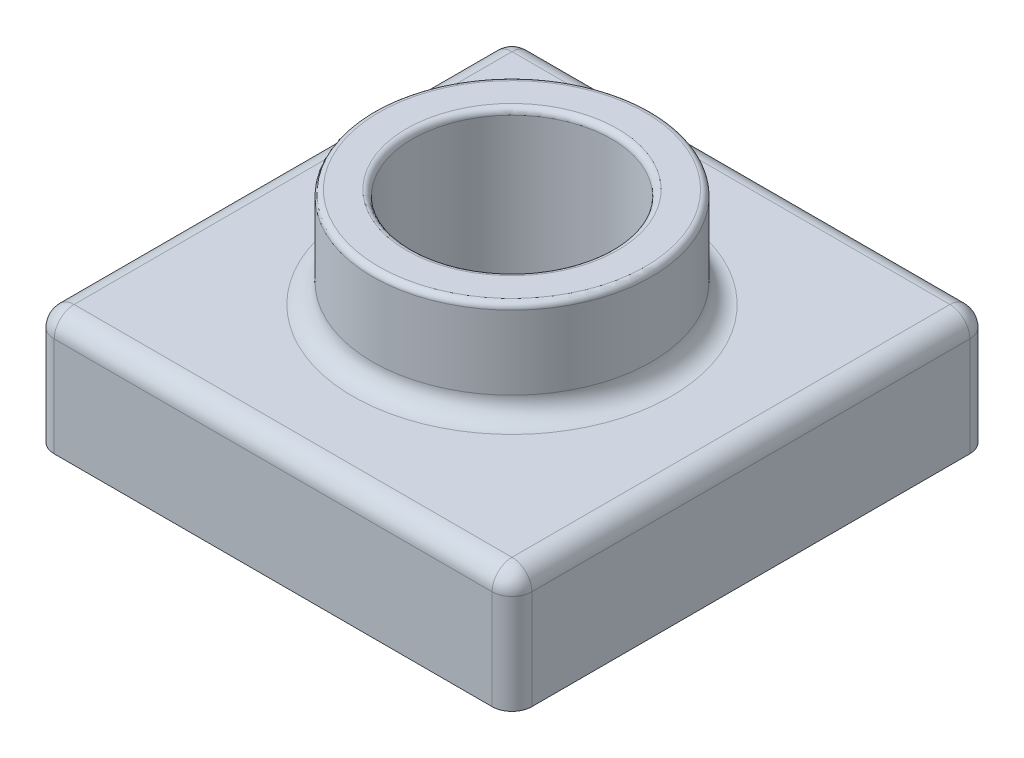
ISO-10303-21;
HEADER;
FILE_DESCRIPTION(('STEP AP214'),'2;1');
FILE_NAME('part.step','',(''),(''),'','','');
FILE_SCHEMA(('AUTOMOTIVE_DESIGN { 1 0 10303 214 1 1 1 1 }'));
ENDSEC;
DATA;
#1=APPLICATION_CONTEXT('core data for automotive mechanical design processes');
#2=APPLICATION_PROTOCOL_DEFINITION('international standard','automotive_design',2000,#1);
#3=PRODUCT_CONTEXT('',#1,'mechanical');
#4=PRODUCT('Part','Part','',(#3));
#5=PRODUCT_RELATED_PRODUCT_CATEGORY('part','',(#4));
#6=PRODUCT_DEFINITION_FORMATION('','',#4);
#7=PRODUCT_DEFINITION_CONTEXT('part definition',#1,'design');
#8=PRODUCT_DEFINITION('design','',#6,#7);
#9=PRODUCT_DEFINITION_SHAPE('','',#8);
#10=(LENGTH_UNIT() NAMED_UNIT(*) SI_UNIT(.MILLI.,.METRE.));
#11=(NAMED_UNIT(*) PLANE_ANGLE_UNIT() SI_UNIT($,.RADIAN.));
#12=(NAMED_UNIT(*) SI_UNIT($,.STERADIAN.) SOLID_ANGLE_UNIT());
#13=UNCERTAINTY_MEASURE_WITH_UNIT(LENGTH_MEASURE(1.E-05),#10,'distance_accuracy_value','');
#14=(GEOMETRIC_REPRESENTATION_CONTEXT(3) GLOBAL_UNCERTAINTY_ASSIGNED_CONTEXT((#13)) GLOBAL_UNIT_ASSIGNED_CONTEXT((#10,
#11,#12)) REPRESENTATION_CONTEXT('',''));
#15=CARTESIAN_POINT('',(0.,0.,0.));
#16=DIRECTION('',(0.,0.,1.));
#17=DIRECTION('',(1.,0.,0.));
#18=AXIS2_PLACEMENT_3D('',#15,#16,#17);
#19=CARTESIAN_POINT('',(0.,0.,0.));
#20=DIRECTION('',(0.,-1.,0.));
#21=DIRECTION('',(0.,0.,-1.));
#22=AXIS2_PLACEMENT_3D('',#19,#20,#21);
#23=PLANE('',#22);
#24=DIRECTION('',(0.,0.,1.));
#25=VECTOR('',#24,1.);
#26=CARTESIAN_POINT('',(0.,0.,0.));
#27=LINE('',#26,#25);
#28=CARTESIAN_POINT('',(0.,0.,-115.));
#29=VERTEX_POINT('',#28);
#30=CARTESIAN_POINT('',(0.,0.,-5.));
#31=VERTEX_POINT('',#30);
#32=EDGE_CURVE('E260',#29,#31,#27,.T.);
#33=ORIENTED_EDGE('',*,*,#32,.F.);
#34=CARTESIAN_POINT('',(5.,0.,-115.));
#35=DIRECTION('',(0.,-1.,0.));
#36=DIRECTION('',(0.,0.,-1.));
#37=AXIS2_PLACEMENT_3D('',#34,#35,#36);
#38=CIRCLE('',#37,5.);
#39=CARTESIAN_POINT('',(5.,0.,-120.));
#40=VERTEX_POINT('',#39);
#41=EDGE_CURVE('E318',#29,#40,#38,.T.);
#42=ORIENTED_EDGE('',*,*,#41,.T.);
#43=DIRECTION('',(-1.,0.,0.));
#44=VECTOR('',#43,1.);
#45=CARTESIAN_POINT('',(0.,0.,-120.));
#46=LINE('',#45,#44);
#47=CARTESIAN_POINT('',(115.,0.,-120.));
#48=VERTEX_POINT('',#47);
#49=EDGE_CURVE('E270',#48,#40,#46,.T.);
#50=ORIENTED_EDGE('',*,*,#49,.F.);
#51=CARTESIAN_POINT('',(115.,0.,-115.));
#52=DIRECTION('',(0.,-1.,0.));
#53=DIRECTION('',(0.,0.,-1.));
#54=AXIS2_PLACEMENT_3D('',#51,#52,#53);
#55=CIRCLE('',#54,5.);
#56=CARTESIAN_POINT('',(120.,0.,-115.));
#57=VERTEX_POINT('',#56);
#58=EDGE_CURVE('E316',#48,#57,#55,.T.);
#59=ORIENTED_EDGE('',*,*,#58,.T.);
#60=DIRECTION('',(0.,0.,-1.));
#61=VECTOR('',#60,1.);
#62=CARTESIAN_POINT('',(120.,0.,0.));
#63=LINE('',#62,#61);
#64=CARTESIAN_POINT('',(120.,0.,-5.));
#65=VERTEX_POINT('',#64);
#66=EDGE_CURVE('E267',#65,#57,#63,.T.);
#67=ORIENTED_EDGE('',*,*,#66,.F.);
#68=CARTESIAN_POINT('',(115.,0.,-5.));
#69=DIRECTION('',(0.,-1.,0.));
#70=DIRECTION('',(0.,0.,-1.));
#71=AXIS2_PLACEMENT_3D('',#68,#69,#70);
#72=CIRCLE('',#71,5.);
#73=CARTESIAN_POINT('',(115.,0.,0.));
#74=VERTEX_POINT('',#73);
#75=EDGE_CURVE('E314',#65,#74,#72,.T.);
#76=ORIENTED_EDGE('',*,*,#75,.T.);
#77=DIRECTION('',(1.,0.,0.));
#78=VECTOR('',#77,1.);
#79=CARTESIAN_POINT('',(0.,0.,0.));
#80=LINE('',#79,#78);
#81=CARTESIAN_POINT('',(5.,0.,0.));
#82=VERTEX_POINT('',#81);
#83=EDGE_CURVE('E264',#82,#74,#80,.T.);
#84=ORIENTED_EDGE('',*,*,#83,.F.);
#85=CARTESIAN_POINT('',(5.,0.,-5.));
#86=DIRECTION('',(0.,-1.,0.));
#87=DIRECTION('',(0.,0.,-1.));
#88=AXIS2_PLACEMENT_3D('',#85,#86,#87);
#89=CIRCLE('',#88,5.);
#90=EDGE_CURVE('E312',#82,#31,#89,.T.);
#91=ORIENTED_EDGE('',*,*,#90,.T.);
#92=EDGE_LOOP('',(#33,#42,#50,#59,#67,#76,#84,#91));
#93=FACE_BOUND('',#92,.T.);
#94=CARTESIAN_POINT('',(5.,0.,-115.));
#95=DIRECTION('',(0.,-1.,0.));
#96=DIRECTION('',(0.,0.,-1.));
#97=AXIS2_PLACEMENT_3D('',#94,#95,#96);
#98=CIRCLE('',#97,3.);
#99=CARTESIAN_POINT('',(2.,0.,-115.));
#100=VERTEX_POINT('',#99);
#101=CARTESIAN_POINT('',(5.,0.,-118.));
#102=VERTEX_POINT('',#101);
#103=EDGE_CURVE('E234',#100,#102,#98,.T.);
#104=ORIENTED_EDGE('',*,*,#103,.F.);
#105=DIRECTION('',(0.,0.,1.));
#106=VECTOR('',#105,1.);
#107=CARTESIAN_POINT('',(2.,0.,0.));
#108=LINE('',#107,#106);
#109=CARTESIAN_POINT('',(2.,0.,-5.));
#110=VERTEX_POINT('',#109);
#111=EDGE_CURVE('E190',#100,#110,#108,.T.);
#112=ORIENTED_EDGE('',*,*,#111,.T.);
#113=CARTESIAN_POINT('',(5.,0.,-5.));
#114=DIRECTION('',(0.,-1.,0.));
#115=DIRECTION('',(0.,0.,-1.));
#116=AXIS2_PLACEMENT_3D('',#113,#114,#115);
#117=CIRCLE('',#116,3.);
#118=CARTESIAN_POINT('',(5.,0.,-2.));
#119=VERTEX_POINT('',#118);
#120=EDGE_CURVE('E229',#119,#110,#117,.T.);
#121=ORIENTED_EDGE('',*,*,#120,.F.);
#122=DIRECTION('',(1.,0.,0.));
#123=VECTOR('',#122,1.);
#124=CARTESIAN_POINT('',(0.,0.,-2.));
#125=LINE('',#124,#123);
#126=CARTESIAN_POINT('',(115.,0.,-2.));
#127=VERTEX_POINT('',#126);
#128=EDGE_CURVE('E49',#119,#127,#125,.T.);
#129=ORIENTED_EDGE('',*,*,#128,.T.);
#130=CARTESIAN_POINT('',(115.,0.,-5.));
#131=DIRECTION('',(0.,-1.,0.));
#132=DIRECTION('',(0.,0.,-1.));
#133=AXIS2_PLACEMENT_3D('',#130,#131,#132);
#134=CIRCLE('',#133,3.);
#135=CARTESIAN_POINT('',(118.,0.,-5.));
#136=VERTEX_POINT('',#135);
#137=EDGE_CURVE('E248',#136,#127,#134,.T.);
#138=ORIENTED_EDGE('',*,*,#137,.F.);
#139=DIRECTION('',(0.,0.,-1.));
#140=VECTOR('',#139,1.);
#141=CARTESIAN_POINT('',(118.,0.,0.));
#142=LINE('',#141,#140);
#143=CARTESIAN_POINT('',(118.,0.,-115.));
#144=VERTEX_POINT('',#143);
#145=EDGE_CURVE('E246',#136,#144,#142,.T.);
#146=ORIENTED_EDGE('',*,*,#145,.T.);
#147=CARTESIAN_POINT('',(115.,0.,-115.));
#148=DIRECTION('',(0.,-1.,0.));
#149=DIRECTION('',(0.,0.,-1.));
#150=AXIS2_PLACEMENT_3D('',#147,#148,#149);
#151=CIRCLE('',#150,3.);
#152=CARTESIAN_POINT('',(115.,0.,-118.));
#153=VERTEX_POINT('',#152);
#154=EDGE_CURVE('E241',#153,#144,#151,.T.);
#155=ORIENTED_EDGE('',*,*,#154,.F.);
#156=DIRECTION('',(-1.,0.,0.));
#157=VECTOR('',#156,1.);
#158=CARTESIAN_POINT('',(0.,0.,-118.));
#159=LINE('',#158,#157);
#160=EDGE_CURVE('E242',#153,#102,#159,.T.);
#161=ORIENTED_EDGE('',*,*,#160,.T.);
#162=EDGE_LOOP('',(#104,#112,#121,#129,#138,#146,#155,#161));
#163=FACE_BOUND('',#162,.T.);
#164=ADVANCED_FACE('F34',(#93,#163),#23,.T.);
#165=CARTESIAN_POINT('',(0.,30.,0.));
#166=DIRECTION('',(1.,0.,0.));
#167=DIRECTION('',(0.,0.,-1.));
#168=AXIS2_PLACEMENT_3D('',#165,#166,#167);
#169=PLANE('',#168);
#170=DIRECTION('',(0.,0.,1.));
#171=VECTOR('',#170,1.);
#172=CARTESIAN_POINT('',(0.,25.,0.));
#173=LINE('',#172,#171);
#174=CARTESIAN_POINT('',(0.,25.,-5.));
#175=VERTEX_POINT('',#174);
#176=CARTESIAN_POINT('',(0.,25.,-115.));
#177=VERTEX_POINT('',#176);
#178=EDGE_CURVE('E57',#175,#177,#173,.F.);
#179=ORIENTED_EDGE('',*,*,#178,.T.);
#180=DIRECTION('',(0.,-1.,0.));
#181=VECTOR('',#180,1.);
#182=CARTESIAN_POINT('',(0.,30.,-115.));
#183=LINE('',#182,#181);
#184=EDGE_CURVE('E307',#177,#29,#183,.T.);
#185=ORIENTED_EDGE('',*,*,#184,.T.);
#186=ORIENTED_EDGE('',*,*,#32,.T.);
#187=DIRECTION('',(0.,-1.,0.));
#188=VECTOR('',#187,1.);
#189=CARTESIAN_POINT('',(0.,30.,-5.));
#190=LINE('',#189,#188);
#191=EDGE_CURVE('E304',#31,#175,#190,.F.);
#192=ORIENTED_EDGE('',*,*,#191,.T.);
#193=EDGE_LOOP('',(#179,#185,#186,#192));
#194=FACE_BOUND('',#193,.T.);
#195=ADVANCED_FACE('F402',(#194),#169,.F.);
#196=CARTESIAN_POINT('',(0.,30.,0.));
#197=DIRECTION('',(0.,0.,-1.));
#198=DIRECTION('',(-1.,0.,0.));
#199=AXIS2_PLACEMENT_3D('',#196,#197,#198);
#200=PLANE('',#199);
#201=ORIENTED_EDGE('',*,*,#83,.T.);
#202=DIRECTION('',(0.,-1.,0.));
#203=VECTOR('',#202,1.);
#204=CARTESIAN_POINT('',(115.,30.,0.));
#205=LINE('',#204,#203);
#206=CARTESIAN_POINT('',(115.,25.,0.));
#207=VERTEX_POINT('',#206);
#208=EDGE_CURVE('E302',#74,#207,#205,.F.);
#209=ORIENTED_EDGE('',*,*,#208,.T.);
#210=DIRECTION('',(1.,0.,0.));
#211=VECTOR('',#210,1.);
#212=CARTESIAN_POINT('',(0.,25.,0.));
#213=LINE('',#212,#211);
#214=CARTESIAN_POINT('',(5.,25.,0.));
#215=VERTEX_POINT('',#214);
#216=EDGE_CURVE('E300',#207,#215,#213,.F.);
#217=ORIENTED_EDGE('',*,*,#216,.T.);
#218=DIRECTION('',(0.,-1.,0.));
#219=VECTOR('',#218,1.);
#220=CARTESIAN_POINT('',(5.,30.,0.));
#221=LINE('',#220,#219);
#222=EDGE_CURVE('E298',#215,#82,#221,.T.);
#223=ORIENTED_EDGE('',*,*,#222,.T.);
#224=EDGE_LOOP('',(#201,#209,#217,#223));
#225=FACE_BOUND('',#224,.T.);
#226=ADVANCED_FACE('F407',(#225),#200,.F.);
#227=CARTESIAN_POINT('',(120.,30.,0.));
#228=DIRECTION('',(-1.,0.,0.));
#229=DIRECTION('',(0.,0.,1.));
#230=AXIS2_PLACEMENT_3D('',#227,#228,#229);
#231=PLANE('',#230);
#232=ORIENTED_EDGE('',*,*,#66,.T.);
#233=DIRECTION('',(0.,-1.,0.));
#234=VECTOR('',#233,1.);
#235=CARTESIAN_POINT('',(120.,30.,-115.));
#236=LINE('',#235,#234);
#237=CARTESIAN_POINT('',(120.,25.,-115.));
#238=VERTEX_POINT('',#237);
#239=EDGE_CURVE('E296',#57,#238,#236,.F.);
#240=ORIENTED_EDGE('',*,*,#239,.T.);
#241=DIRECTION('',(0.,0.,-1.));
#242=VECTOR('',#241,1.);
#243=CARTESIAN_POINT('',(120.,25.,0.));
#244=LINE('',#243,#242);
#245=CARTESIAN_POINT('',(120.,25.,-5.));
#246=VERTEX_POINT('',#245);
#247=EDGE_CURVE('E294',#238,#246,#244,.F.);
#248=ORIENTED_EDGE('',*,*,#247,.T.);
#249=DIRECTION('',(0.,-1.,0.));
#250=VECTOR('',#249,1.);
#251=CARTESIAN_POINT('',(120.,30.,-5.));
#252=LINE('',#251,#250);
#253=EDGE_CURVE('E292',#246,#65,#252,.T.);
#254=ORIENTED_EDGE('',*,*,#253,.T.);
#255=EDGE_LOOP('',(#232,#240,#248,#254));
#256=FACE_BOUND('',#255,.T.);
#257=ADVANCED_FACE('F817',(#256),#231,.F.);
#258=CARTESIAN_POINT('',(0.,30.,-120.));
#259=DIRECTION('',(0.,0.,1.));
#260=DIRECTION('',(1.,0.,0.));
#261=AXIS2_PLACEMENT_3D('',#258,#259,#260);
#262=PLANE('',#261);
#263=ORIENTED_EDGE('',*,*,#49,.T.);
#264=DIRECTION('',(0.,-1.,0.));
#265=VECTOR('',#264,1.);
#266=CARTESIAN_POINT('',(5.,30.,-120.));
#267=LINE('',#266,#265);
#268=CARTESIAN_POINT('',(5.,25.,-120.));
#269=VERTEX_POINT('',#268);
#270=EDGE_CURVE('E290',#40,#269,#267,.F.);
#271=ORIENTED_EDGE('',*,*,#270,.T.);
#272=DIRECTION('',(-1.,0.,0.));
#273=VECTOR('',#272,1.);
#274=CARTESIAN_POINT('',(0.,25.,-120.));
#275=LINE('',#274,#273);
#276=CARTESIAN_POINT('',(115.,25.,-120.));
#277=VERTEX_POINT('',#276);
#278=EDGE_CURVE('E287',#269,#277,#275,.F.);
#279=ORIENTED_EDGE('',*,*,#278,.T.);
#280=DIRECTION('',(0.,-1.,0.));
#281=VECTOR('',#280,1.);
#282=CARTESIAN_POINT('',(115.,30.,-120.));
#283=LINE('',#282,#281);
#284=EDGE_CURVE('E285',#277,#48,#283,.T.);
#285=ORIENTED_EDGE('',*,*,#284,.T.);
#286=EDGE_LOOP('',(#263,#271,#279,#285));
#287=FACE_BOUND('',#286,.T.);
#288=ADVANCED_FACE('F396',(#287),#262,.F.);
#289=CARTESIAN_POINT('',(0.,30.,0.));
#290=DIRECTION('',(0.,-1.,0.));
#291=DIRECTION('',(0.,0.,-1.));
#292=AXIS2_PLACEMENT_3D('',#289,#290,#291);
#293=PLANE('',#292);
#294=DIRECTION('',(0.,0.,-1.));
#295=VECTOR('',#294,1.);
#296=CARTESIAN_POINT('',(115.,30.,0.));
#297=LINE('',#296,#295);
#298=CARTESIAN_POINT('',(115.,30.,-5.));
#299=VERTEX_POINT('',#298);
#300=CARTESIAN_POINT('',(115.,30.,-115.));
#301=VERTEX_POINT('',#300);
#302=EDGE_CURVE('E280',#299,#301,#297,.T.);
#303=ORIENTED_EDGE('',*,*,#302,.T.);
#304=DIRECTION('',(-1.,0.,0.));
#305=VECTOR('',#304,1.);
#306=CARTESIAN_POINT('',(0.,30.,-115.));
#307=LINE('',#306,#305);
#308=CARTESIAN_POINT('',(5.,30.,-115.));
#309=VERTEX_POINT('',#308);
#310=EDGE_CURVE('E282',#301,#309,#307,.T.);
#311=ORIENTED_EDGE('',*,*,#310,.T.);
#312=DIRECTION('',(0.,0.,1.));
#313=VECTOR('',#312,1.);
#314=CARTESIAN_POINT('',(5.,30.,0.));
#315=LINE('',#314,#313);
#316=CARTESIAN_POINT('',(5.,30.,-5.));
#317=VERTEX_POINT('',#316);
#318=EDGE_CURVE('E276',#309,#317,#315,.T.);
#319=ORIENTED_EDGE('',*,*,#318,.T.);
#320=DIRECTION('',(1.,0.,0.));
#321=VECTOR('',#320,1.);
#322=CARTESIAN_POINT('',(0.,30.,-5.));
#323=LINE('',#322,#321);
#324=EDGE_CURVE('E278',#317,#299,#323,.T.);
#325=ORIENTED_EDGE('',*,*,#324,.T.);
#326=EDGE_LOOP('',(#303,#311,#319,#325));
#327=FACE_BOUND('',#326,.T.);
#328=CARTESIAN_POINT('',(60.,30.,-60.));
#329=DIRECTION('',(0.,-1.,0.));
#330=DIRECTION('',(0.,0.,-1.));
#331=AXIS2_PLACEMENT_3D('',#328,#329,#330);
#332=CIRCLE('',#331,40.);
#333=CARTESIAN_POINT('',(60.,30.,-100.));
#334=VERTEX_POINT('',#333);
#335=EDGE_CURVE('E273',#334,#334,#332,.T.);
#336=ORIENTED_EDGE('',*,*,#335,.T.);
#337=EDGE_LOOP('',(#336));
#338=FACE_BOUND('',#337,.T.);
#339=ADVANCED_FACE('F388',(#327,#338),#293,.F.);
#340=CARTESIAN_POINT('',(60.,0.,-60.));
#341=DIRECTION('',(0.,-1.,0.));
#342=DIRECTION('',(0.,0.,-1.));
#343=AXIS2_PLACEMENT_3D('',#340,#341,#342);
#344=CIRCLE('',#343,27.);
#345=CARTESIAN_POINT('',(60.,0.,-87.));
#346=VERTEX_POINT('',#345);
#347=EDGE_CURVE('E239',#346,#346,#344,.F.);
#348=ORIENTED_EDGE('',*,*,#347,.F.);
#349=EDGE_LOOP('',(#348));
#350=FACE_BOUND('',#349,.T.);
#351=CARTESIAN_POINT('',(60.,0.,-60.));
#352=DIRECTION('',(0.,1.,0.));
#353=DIRECTION('',(0.,0.,1.));
#354=AXIS2_PLACEMENT_3D('',#351,#352,#353);
#355=CIRCLE('',#354,25.);
#356=CARTESIAN_POINT('',(60.,0.,-35.));
#357=VERTEX_POINT('',#356);
#358=EDGE_CURVE('E257',#357,#357,#355,.T.);
#359=ORIENTED_EDGE('',*,*,#358,.T.);
#360=EDGE_LOOP('',(#359));
#361=FACE_BOUND('',#360,.T.);
#362=ADVANCED_FACE('F386',(#350,#361),#23,.T.);
#363=CARTESIAN_POINT('',(60.,55.,-60.));
#364=DIRECTION('',(0.,-1.,0.));
#365=DIRECTION('',(0.,0.,-1.));
#366=AXIS2_PLACEMENT_3D('',#363,#364,#365);
#367=CYLINDRICAL_SURFACE('',#366,35.);
#368=CARTESIAN_POINT('',(60.,53.5,-60.));
#369=DIRECTION('',(0.,1.,0.));
#370=DIRECTION('',(0.,0.,1.));
#371=AXIS2_PLACEMENT_3D('',#368,#369,#370);
#372=CIRCLE('',#371,35.);
#373=CARTESIAN_POINT('',(60.,53.5,-25.));
#374=VERTEX_POINT('',#373);
#375=EDGE_CURVE('E42',#374,#374,#372,.F.);
#376=ORIENTED_EDGE('',*,*,#375,.T.);
#377=EDGE_LOOP('',(#376));
#378=FACE_BOUND('',#377,.T.);
#379=CARTESIAN_POINT('',(60.,35.,-60.));
#380=DIRECTION('',(0.,-1.,0.));
#381=DIRECTION('',(0.,0.,-1.));
#382=AXIS2_PLACEMENT_3D('',#379,#380,#381);
#383=CIRCLE('',#382,35.);
#384=CARTESIAN_POINT('',(60.,35.,-95.));
#385=VERTEX_POINT('',#384);
#386=EDGE_CURVE('E309',#385,#385,#383,.F.);
#387=ORIENTED_EDGE('',*,*,#386,.T.);
#388=EDGE_LOOP('',(#387));
#389=FACE_BOUND('',#388,.T.);
#390=ADVANCED_FACE('F360',(#378,#389),#367,.T.);
#391=CARTESIAN_POINT('',(60.,55.,-60.));
#392=DIRECTION('',(0.,1.,0.));
#393=DIRECTION('',(0.,0.,1.));
#394=AXIS2_PLACEMENT_3D('',#391,#392,#393);
#395=PLANE('',#394);
#396=CARTESIAN_POINT('',(60.,55.,-60.));
#397=DIRECTION('',(0.,1.,0.));
#398=DIRECTION('',(0.,0.,1.));
#399=AXIS2_PLACEMENT_3D('',#396,#397,#398);
#400=CIRCLE('',#399,33.5);
#401=CARTESIAN_POINT('',(60.,55.,-26.5));
#402=VERTEX_POINT('',#401);
#403=EDGE_CURVE('E355',#402,#402,#400,.T.);
#404=ORIENTED_EDGE('',*,*,#403,.T.);
#405=EDGE_LOOP('',(#404));
#406=FACE_BOUND('',#405,.T.);
#407=CARTESIAN_POINT('',(60.,55.,-60.));
#408=DIRECTION('',(0.,1.,0.));
#409=DIRECTION('',(0.,0.,1.));
#410=AXIS2_PLACEMENT_3D('',#407,#408,#409);
#411=CIRCLE('',#410,26.5);
#412=CARTESIAN_POINT('',(60.,55.,-33.5));
#413=VERTEX_POINT('',#412);
#414=EDGE_CURVE('E320',#413,#413,#411,.F.);
#415=ORIENTED_EDGE('',*,*,#414,.T.);
#416=EDGE_LOOP('',(#415));
#417=FACE_BOUND('',#416,.T.);
#418=ADVANCED_FACE('F369',(#406,#417),#395,.T.);
#419=CARTESIAN_POINT('',(60.,0.,-60.));
#420=DIRECTION('',(0.,1.,0.));
#421=DIRECTION('',(0.,0.,1.));
#422=AXIS2_PLACEMENT_3D('',#419,#420,#421);
#423=CYLINDRICAL_SURFACE('',#422,25.);
#424=CARTESIAN_POINT('',(60.,53.5,-60.));
#425=DIRECTION('',(0.,1.,0.));
#426=DIRECTION('',(0.,0.,1.));
#427=AXIS2_PLACEMENT_3D('',#424,#425,#426);
#428=CIRCLE('',#427,25.);
#429=CARTESIAN_POINT('',(60.,53.5,-35.));
#430=VERTEX_POINT('',#429);
#431=EDGE_CURVE('E11',#430,#430,#428,.T.);
#432=ORIENTED_EDGE('',*,*,#431,.T.);
#433=EDGE_LOOP('',(#432));
#434=FACE_BOUND('',#433,.T.);
#435=ORIENTED_EDGE('',*,*,#358,.F.);
#436=EDGE_LOOP('',(#435));
#437=FACE_BOUND('',#436,.T.);
#438=ADVANCED_FACE('F372',(#434,#437),#423,.F.);
#439=CARTESIAN_POINT('',(115.,30.,-5.));
#440=DIRECTION('',(0.,-1.,0.));
#441=DIRECTION('',(0.,0.,-1.));
#442=AXIS2_PLACEMENT_3D('',#439,#440,#441);
#443=CYLINDRICAL_SURFACE('',#442,5.);
#444=ORIENTED_EDGE('',*,*,#75,.F.);
#445=ORIENTED_EDGE('',*,*,#253,.F.);
#446=CARTESIAN_POINT('',(115.,25.,-5.));
#447=DIRECTION('',(0.,1.,0.));
#448=DIRECTION('',(0.,0.,1.));
#449=AXIS2_PLACEMENT_3D('',#446,#447,#448);
#450=CIRCLE('',#449,5.);
#451=EDGE_CURVE('E261',#207,#246,#450,.T.);
#452=ORIENTED_EDGE('',*,*,#451,.F.);
#453=ORIENTED_EDGE('',*,*,#208,.F.);
#454=EDGE_LOOP('',(#444,#445,#452,#453));
#455=FACE_BOUND('',#454,.T.);
#456=ADVANCED_FACE('F382',(#455),#443,.T.);
#457=CARTESIAN_POINT('',(0.,25.,-5.));
#458=DIRECTION('',(1.,0.,0.));
#459=DIRECTION('',(0.,0.,-1.));
#460=AXIS2_PLACEMENT_3D('',#457,#458,#459);
#461=CYLINDRICAL_SURFACE('',#460,5.);
#462=CARTESIAN_POINT('',(5.,25.,-5.));
#463=DIRECTION('',(-1.,0.,0.));
#464=DIRECTION('',(0.,0.,1.));
#465=AXIS2_PLACEMENT_3D('',#462,#463,#464);
#466=CIRCLE('',#465,5.);
#467=EDGE_CURVE('E345',#215,#317,#466,.T.);
#468=ORIENTED_EDGE('',*,*,#467,.F.);
#469=ORIENTED_EDGE('',*,*,#216,.F.);
#470=CARTESIAN_POINT('',(115.,25.,-5.));
#471=DIRECTION('',(1.,0.,0.));
#472=DIRECTION('',(0.,0.,-1.));
#473=AXIS2_PLACEMENT_3D('',#470,#471,#472);
#474=CIRCLE('',#473,5.);
#475=EDGE_CURVE('E348',#299,#207,#474,.T.);
#476=ORIENTED_EDGE('',*,*,#475,.F.);
#477=ORIENTED_EDGE('',*,*,#324,.F.);
#478=EDGE_LOOP('',(#468,#469,#476,#477));
#479=FACE_BOUND('',#478,.T.);
#480=ADVANCED_FACE('F770',(#479),#461,.T.);
#481=CARTESIAN_POINT('',(5.,30.,-5.));
#482=DIRECTION('',(0.,-1.,0.));
#483=DIRECTION('',(0.,0.,-1.));
#484=AXIS2_PLACEMENT_3D('',#481,#482,#483);
#485=CYLINDRICAL_SURFACE('',#484,5.);
#486=ORIENTED_EDGE('',*,*,#90,.F.);
#487=ORIENTED_EDGE('',*,*,#222,.F.);
#488=CARTESIAN_POINT('',(5.,25.,-5.));
#489=DIRECTION('',(0.,1.,0.));
#490=DIRECTION('',(0.,0.,1.));
#491=AXIS2_PLACEMENT_3D('',#488,#489,#490);
#492=CIRCLE('',#491,5.);
#493=EDGE_CURVE('E342',#175,#215,#492,.T.);
#494=ORIENTED_EDGE('',*,*,#493,.F.);
#495=ORIENTED_EDGE('',*,*,#191,.F.);
#496=EDGE_LOOP('',(#486,#487,#494,#495));
#497=FACE_BOUND('',#496,.T.);
#498=ADVANCED_FACE('F761',(#497),#485,.T.);
#499=CARTESIAN_POINT('',(115.,25.,-5.));
#500=DIRECTION('',(0.,0.,1.));
#501=DIRECTION('',(1.,0.,0.));
#502=AXIS2_PLACEMENT_3D('',#499,#500,#501);
#503=SPHERICAL_SURFACE('',#502,5.);
#504=ORIENTED_EDGE('',*,*,#475,.T.);
#505=ORIENTED_EDGE('',*,*,#451,.T.);
#506=CARTESIAN_POINT('',(115.,25.,-5.));
#507=DIRECTION('',(0.,0.,1.));
#508=DIRECTION('',(1.,0.,0.));
#509=AXIS2_PLACEMENT_3D('',#506,#507,#508);
#510=CIRCLE('',#509,5.);
#511=EDGE_CURVE('E339',#299,#246,#510,.F.);
#512=ORIENTED_EDGE('',*,*,#511,.F.);
#513=EDGE_LOOP('',(#504,#505,#512));
#514=FACE_BOUND('',#513,.T.);
#515=ADVANCED_FACE('F752',(#514),#503,.T.);
#516=CARTESIAN_POINT('',(5.,25.,-5.));
#517=DIRECTION('',(0.,0.,1.));
#518=DIRECTION('',(1.,0.,0.));
#519=AXIS2_PLACEMENT_3D('',#516,#517,#518);
#520=SPHERICAL_SURFACE('',#519,5.);
#521=ORIENTED_EDGE('',*,*,#493,.T.);
#522=ORIENTED_EDGE('',*,*,#467,.T.);
#523=CARTESIAN_POINT('',(5.,25.,-5.));
#524=DIRECTION('',(0.,0.,1.));
#525=DIRECTION('',(1.,0.,0.));
#526=AXIS2_PLACEMENT_3D('',#523,#524,#525);
#527=CIRCLE('',#526,5.);
#528=EDGE_CURVE('E336',#175,#317,#527,.F.);
#529=ORIENTED_EDGE('',*,*,#528,.F.);
#530=EDGE_LOOP('',(#521,#522,#529));
#531=FACE_BOUND('',#530,.T.);
#532=ADVANCED_FACE('F743',(#531),#520,.T.);
#533=CARTESIAN_POINT('',(115.,30.,-115.));
#534=DIRECTION('',(0.,-1.,0.));
#535=DIRECTION('',(0.,0.,-1.));
#536=AXIS2_PLACEMENT_3D('',#533,#534,#535);
#537=CYLINDRICAL_SURFACE('',#536,5.);
#538=ORIENTED_EDGE('',*,*,#58,.F.);
#539=ORIENTED_EDGE('',*,*,#284,.F.);
#540=CARTESIAN_POINT('',(115.,25.,-115.));
#541=DIRECTION('',(0.,1.,0.));
#542=DIRECTION('',(0.,0.,1.));
#543=AXIS2_PLACEMENT_3D('',#540,#541,#542);
#544=CIRCLE('',#543,5.);
#545=EDGE_CURVE('E333',#238,#277,#544,.T.);
#546=ORIENTED_EDGE('',*,*,#545,.F.);
#547=ORIENTED_EDGE('',*,*,#239,.F.);
#548=EDGE_LOOP('',(#538,#539,#546,#547));
#549=FACE_BOUND('',#548,.T.);
#550=ADVANCED_FACE('F734',(#549),#537,.T.);
#551=CARTESIAN_POINT('',(115.,25.,0.));
#552=DIRECTION('',(0.,0.,-1.));
#553=DIRECTION('',(-1.,0.,0.));
#554=AXIS2_PLACEMENT_3D('',#551,#552,#553);
#555=CYLINDRICAL_SURFACE('',#554,5.);
#556=ORIENTED_EDGE('',*,*,#511,.T.);
#557=ORIENTED_EDGE('',*,*,#247,.F.);
#558=CARTESIAN_POINT('',(115.,25.,-115.));
#559=DIRECTION('',(0.,0.,-1.));
#560=DIRECTION('',(-1.,0.,0.));
#561=AXIS2_PLACEMENT_3D('',#558,#559,#560);
#562=CIRCLE('',#561,5.);
#563=EDGE_CURVE('E330',#301,#238,#562,.T.);
#564=ORIENTED_EDGE('',*,*,#563,.F.);
#565=ORIENTED_EDGE('',*,*,#302,.F.);
#566=EDGE_LOOP('',(#556,#557,#564,#565));
#567=FACE_BOUND('',#566,.T.);
#568=ADVANCED_FACE('F725',(#567),#555,.T.);
#569=CARTESIAN_POINT('',(5.,25.,0.));
#570=DIRECTION('',(0.,0.,1.));
#571=DIRECTION('',(1.,0.,0.));
#572=AXIS2_PLACEMENT_3D('',#569,#570,#571);
#573=CYLINDRICAL_SURFACE('',#572,5.);
#574=ORIENTED_EDGE('',*,*,#528,.T.);
#575=ORIENTED_EDGE('',*,*,#318,.F.);
#576=CARTESIAN_POINT('',(5.,25.,-115.));
#577=DIRECTION('',(0.,0.,-1.));
#578=DIRECTION('',(-1.,0.,0.));
#579=AXIS2_PLACEMENT_3D('',#576,#577,#578);
#580=CIRCLE('',#579,5.);
#581=EDGE_CURVE('E327',#177,#309,#580,.T.);
#582=ORIENTED_EDGE('',*,*,#581,.F.);
#583=ORIENTED_EDGE('',*,*,#178,.F.);
#584=EDGE_LOOP('',(#574,#575,#582,#583));
#585=FACE_BOUND('',#584,.T.);
#586=ADVANCED_FACE('F716',(#585),#573,.T.);
#587=CARTESIAN_POINT('',(5.,30.,-115.));
#588=DIRECTION('',(0.,-1.,0.));
#589=DIRECTION('',(0.,0.,-1.));
#590=AXIS2_PLACEMENT_3D('',#587,#588,#589);
#591=CYLINDRICAL_SURFACE('',#590,5.);
#592=ORIENTED_EDGE('',*,*,#41,.F.);
#593=ORIENTED_EDGE('',*,*,#184,.F.);
#594=CARTESIAN_POINT('',(5.,25.,-115.));
#595=DIRECTION('',(0.,1.,0.));
#596=DIRECTION('',(0.,0.,1.));
#597=AXIS2_PLACEMENT_3D('',#594,#595,#596);
#598=CIRCLE('',#597,5.);
#599=EDGE_CURVE('E324',#269,#177,#598,.T.);
#600=ORIENTED_EDGE('',*,*,#599,.F.);
#601=ORIENTED_EDGE('',*,*,#270,.F.);
#602=EDGE_LOOP('',(#592,#593,#600,#601));
#603=FACE_BOUND('',#602,.T.);
#604=ADVANCED_FACE('F707',(#603),#591,.T.);
#605=CARTESIAN_POINT('',(115.,25.,-115.));
#606=DIRECTION('',(1.,0.,0.));
#607=DIRECTION('',(0.,0.,-1.));
#608=AXIS2_PLACEMENT_3D('',#605,#606,#607);
#609=SPHERICAL_SURFACE('',#608,5.);
#610=ORIENTED_EDGE('',*,*,#563,.T.);
#611=ORIENTED_EDGE('',*,*,#545,.T.);
#612=CARTESIAN_POINT('',(115.,25.,-115.));
#613=DIRECTION('',(1.,0.,0.));
#614=DIRECTION('',(0.,0.,-1.));
#615=AXIS2_PLACEMENT_3D('',#612,#613,#614);
#616=CIRCLE('',#615,5.);
#617=EDGE_CURVE('E322',#301,#277,#616,.F.);
#618=ORIENTED_EDGE('',*,*,#617,.F.);
#619=EDGE_LOOP('',(#610,#611,#618));
#620=FACE_BOUND('',#619,.T.);
#621=ADVANCED_FACE('F698',(#620),#609,.T.);
#622=CARTESIAN_POINT('',(5.,25.,-115.));
#623=DIRECTION('',(-1.,0.,0.));
#624=DIRECTION('',(0.,0.,1.));
#625=AXIS2_PLACEMENT_3D('',#622,#623,#624);
#626=SPHERICAL_SURFACE('',#625,5.);
#627=ORIENTED_EDGE('',*,*,#599,.T.);
#628=ORIENTED_EDGE('',*,*,#581,.T.);
#629=CARTESIAN_POINT('',(5.,25.,-115.));
#630=DIRECTION('',(-1.,0.,0.));
#631=DIRECTION('',(0.,0.,1.));
#632=AXIS2_PLACEMENT_3D('',#629,#630,#631);
#633=CIRCLE('',#632,5.);
#634=EDGE_CURVE('E237',#269,#309,#633,.F.);
#635=ORIENTED_EDGE('',*,*,#634,.F.);
#636=EDGE_LOOP('',(#627,#628,#635));
#637=FACE_BOUND('',#636,.T.);
#638=ADVANCED_FACE('F689',(#637),#626,.T.);
#639=CARTESIAN_POINT('',(0.,25.,-115.));
#640=DIRECTION('',(-1.,0.,0.));
#641=DIRECTION('',(0.,0.,1.));
#642=AXIS2_PLACEMENT_3D('',#639,#640,#641);
#643=CYLINDRICAL_SURFACE('',#642,5.);
#644=ORIENTED_EDGE('',*,*,#617,.T.);
#645=ORIENTED_EDGE('',*,*,#278,.F.);
#646=ORIENTED_EDGE('',*,*,#634,.T.);
#647=ORIENTED_EDGE('',*,*,#310,.F.);
#648=EDGE_LOOP('',(#644,#645,#646,#647));
#649=FACE_BOUND('',#648,.T.);
#650=ADVANCED_FACE('F679',(#649),#643,.T.);
#651=CARTESIAN_POINT('',(60.,35.,-60.));
#652=DIRECTION('',(0.,-1.,0.));
#653=DIRECTION('',(0.,0.,-1.));
#654=AXIS2_PLACEMENT_3D('',#651,#652,#653);
#655=TOROIDAL_SURFACE('',#654,40.,5.);
#656=ORIENTED_EDGE('',*,*,#335,.F.);
#657=EDGE_LOOP('',(#656));
#658=FACE_BOUND('',#657,.T.);
#659=ORIENTED_EDGE('',*,*,#386,.F.);
#660=EDGE_LOOP('',(#659));
#661=FACE_BOUND('',#660,.T.);
#662=ADVANCED_FACE('F366',(#658,#661),#655,.F.);
#663=CARTESIAN_POINT('',(60.,53.5,-60.));
#664=DIRECTION('',(0.,1.,0.));
#665=DIRECTION('',(0.,0.,1.));
#666=AXIS2_PLACEMENT_3D('',#663,#664,#665);
#667=TOROIDAL_SURFACE('',#666,33.5,1.5);
#668=ORIENTED_EDGE('',*,*,#375,.F.);
#669=EDGE_LOOP('',(#668));
#670=FACE_BOUND('',#669,.T.);
#671=ORIENTED_EDGE('',*,*,#403,.F.);
#672=EDGE_LOOP('',(#671));
#673=FACE_BOUND('',#672,.T.);
#674=ADVANCED_FACE('F363',(#670,#673),#667,.T.);
#675=CARTESIAN_POINT('',(60.,53.5,-60.));
#676=DIRECTION('',(0.,1.,0.));
#677=DIRECTION('',(0.,0.,1.));
#678=AXIS2_PLACEMENT_3D('',#675,#676,#677);
#679=TOROIDAL_SURFACE('',#678,26.5,1.5);
#680=ORIENTED_EDGE('',*,*,#414,.F.);
#681=EDGE_LOOP('',(#680));
#682=FACE_BOUND('',#681,.T.);
#683=ORIENTED_EDGE('',*,*,#431,.F.);
#684=EDGE_LOOP('',(#683));
#685=FACE_BOUND('',#684,.T.);
#686=ADVANCED_FACE('F36',(#682,#685),#679,.T.);
#687=CARTESIAN_POINT('',(2.,30.,0.));
#688=DIRECTION('',(1.,0.,0.));
#689=DIRECTION('',(0.,0.,-1.));
#690=AXIS2_PLACEMENT_3D('',#687,#688,#689);
#691=PLANE('',#690);
#692=DIRECTION('',(0.,0.,-1.));
#693=VECTOR('',#692,1.);
#694=CARTESIAN_POINT('',(2.,25.,0.));
#695=LINE('',#694,#693);
#696=CARTESIAN_POINT('',(2.,25.,-5.));
#697=VERTEX_POINT('',#696);
#698=CARTESIAN_POINT('',(2.,25.,-115.));
#699=VERTEX_POINT('',#698);
#700=EDGE_CURVE('E174',#697,#699,#695,.T.);
#701=ORIENTED_EDGE('',*,*,#700,.F.);
#702=DIRECTION('',(0.,1.,0.));
#703=VECTOR('',#702,1.);
#704=CARTESIAN_POINT('',(2.,30.,-5.));
#705=LINE('',#704,#703);
#706=EDGE_CURVE('E185',#110,#697,#705,.T.);
#707=ORIENTED_EDGE('',*,*,#706,.F.);
#708=ORIENTED_EDGE('',*,*,#111,.F.);
#709=DIRECTION('',(0.,1.,0.));
#710=VECTOR('',#709,1.);
#711=CARTESIAN_POINT('',(2.,30.,-115.));
#712=LINE('',#711,#710);
#713=EDGE_CURVE('E184',#699,#100,#712,.F.);
#714=ORIENTED_EDGE('',*,*,#713,.F.);
#715=EDGE_LOOP('',(#701,#707,#708,#714));
#716=FACE_BOUND('',#715,.T.);
#717=ADVANCED_FACE('F188',(#716),#691,.T.);
#718=CARTESIAN_POINT('',(0.,30.,-2.));
#719=DIRECTION('',(0.,0.,-1.));
#720=DIRECTION('',(-1.,0.,0.));
#721=AXIS2_PLACEMENT_3D('',#718,#719,#720);
#722=PLANE('',#721);
#723=ORIENTED_EDGE('',*,*,#128,.F.);
#724=DIRECTION('',(0.,1.,0.));
#725=VECTOR('',#724,1.);
#726=CARTESIAN_POINT('',(5.,30.,-2.));
#727=LINE('',#726,#725);
#728=CARTESIAN_POINT('',(5.,25.,-2.));
#729=VERTEX_POINT('',#728);
#730=EDGE_CURVE('E458',#729,#119,#727,.F.);
#731=ORIENTED_EDGE('',*,*,#730,.F.);
#732=DIRECTION('',(-1.,0.,0.));
#733=VECTOR('',#732,1.);
#734=CARTESIAN_POINT('',(0.,25.,-2.));
#735=LINE('',#734,#733);
#736=CARTESIAN_POINT('',(115.,25.,-2.));
#737=VERTEX_POINT('',#736);
#738=EDGE_CURVE('E462',#737,#729,#735,.T.);
#739=ORIENTED_EDGE('',*,*,#738,.F.);
#740=DIRECTION('',(0.,1.,0.));
#741=VECTOR('',#740,1.);
#742=CARTESIAN_POINT('',(115.,30.,-2.));
#743=LINE('',#742,#741);
#744=EDGE_CURVE('E464',#127,#737,#743,.T.);
#745=ORIENTED_EDGE('',*,*,#744,.F.);
#746=EDGE_LOOP('',(#723,#731,#739,#745));
#747=FACE_BOUND('',#746,.T.);
#748=ADVANCED_FACE('F474',(#747),#722,.T.);
#749=CARTESIAN_POINT('',(118.,30.,0.));
#750=DIRECTION('',(-1.,0.,0.));
#751=DIRECTION('',(0.,0.,1.));
#752=AXIS2_PLACEMENT_3D('',#749,#750,#751);
#753=PLANE('',#752);
#754=ORIENTED_EDGE('',*,*,#145,.F.);
#755=DIRECTION('',(0.,1.,0.));
#756=VECTOR('',#755,1.);
#757=CARTESIAN_POINT('',(118.,30.,-5.));
#758=LINE('',#757,#756);
#759=CARTESIAN_POINT('',(118.,25.,-5.));
#760=VERTEX_POINT('',#759);
#761=EDGE_CURVE('E214',#760,#136,#758,.F.);
#762=ORIENTED_EDGE('',*,*,#761,.F.);
#763=DIRECTION('',(0.,0.,1.));
#764=VECTOR('',#763,1.);
#765=CARTESIAN_POINT('',(118.,25.,0.));
#766=LINE('',#765,#764);
#767=CARTESIAN_POINT('',(118.,25.,-115.));
#768=VERTEX_POINT('',#767);
#769=EDGE_CURVE('E454',#768,#760,#766,.T.);
#770=ORIENTED_EDGE('',*,*,#769,.F.);
#771=DIRECTION('',(0.,1.,0.));
#772=VECTOR('',#771,1.);
#773=CARTESIAN_POINT('',(118.,30.,-115.));
#774=LINE('',#773,#772);
#775=EDGE_CURVE('E456',#144,#768,#774,.T.);
#776=ORIENTED_EDGE('',*,*,#775,.F.);
#777=EDGE_LOOP('',(#754,#762,#770,#776));
#778=FACE_BOUND('',#777,.T.);
#779=ADVANCED_FACE('F483',(#778),#753,.T.);
#780=CARTESIAN_POINT('',(0.,30.,-118.));
#781=DIRECTION('',(0.,0.,1.));
#782=DIRECTION('',(1.,0.,0.));
#783=AXIS2_PLACEMENT_3D('',#780,#781,#782);
#784=PLANE('',#783);
#785=ORIENTED_EDGE('',*,*,#160,.F.);
#786=DIRECTION('',(0.,1.,0.));
#787=VECTOR('',#786,1.);
#788=CARTESIAN_POINT('',(115.,30.,-118.));
#789=LINE('',#788,#787);
#790=CARTESIAN_POINT('',(115.,25.,-118.));
#791=VERTEX_POINT('',#790);
#792=EDGE_CURVE('E218',#791,#153,#789,.F.);
#793=ORIENTED_EDGE('',*,*,#792,.F.);
#794=DIRECTION('',(1.,0.,0.));
#795=VECTOR('',#794,1.);
#796=CARTESIAN_POINT('',(0.,25.,-118.));
#797=LINE('',#796,#795);
#798=CARTESIAN_POINT('',(5.,25.,-118.));
#799=VERTEX_POINT('',#798);
#800=EDGE_CURVE('E215',#799,#791,#797,.T.);
#801=ORIENTED_EDGE('',*,*,#800,.F.);
#802=DIRECTION('',(0.,1.,0.));
#803=VECTOR('',#802,1.);
#804=CARTESIAN_POINT('',(5.,30.,-118.));
#805=LINE('',#804,#803);
#806=EDGE_CURVE('E207',#102,#799,#805,.T.);
#807=ORIENTED_EDGE('',*,*,#806,.F.);
#808=EDGE_LOOP('',(#785,#793,#801,#807));
#809=FACE_BOUND('',#808,.T.);
#810=ADVANCED_FACE('F416',(#809),#784,.T.);
#811=CARTESIAN_POINT('',(0.,28.,0.));
#812=DIRECTION('',(0.,-1.,0.));
#813=DIRECTION('',(0.,0.,-1.));
#814=AXIS2_PLACEMENT_3D('',#811,#812,#813);
#815=PLANE('',#814);
#816=DIRECTION('',(0.,0.,-1.));
#817=VECTOR('',#816,1.);
#818=CARTESIAN_POINT('',(115.,28.,0.));
#819=LINE('',#818,#817);
#820=CARTESIAN_POINT('',(115.,28.,-5.));
#821=VERTEX_POINT('',#820);
#822=CARTESIAN_POINT('',(115.,28.,-115.));
#823=VERTEX_POINT('',#822);
#824=EDGE_CURVE('E425',#821,#823,#819,.T.);
#825=ORIENTED_EDGE('',*,*,#824,.F.);
#826=DIRECTION('',(1.,0.,0.));
#827=VECTOR('',#826,1.);
#828=CARTESIAN_POINT('',(0.,28.,-5.));
#829=LINE('',#828,#827);
#830=CARTESIAN_POINT('',(5.,28.,-5.));
#831=VERTEX_POINT('',#830);
#832=EDGE_CURVE('E427',#831,#821,#829,.T.);
#833=ORIENTED_EDGE('',*,*,#832,.F.);
#834=DIRECTION('',(0.,0.,-1.));
#835=VECTOR('',#834,1.);
#836=CARTESIAN_POINT('',(5.,28.,0.));
#837=LINE('',#836,#835);
#838=CARTESIAN_POINT('',(5.,28.,-115.));
#839=VERTEX_POINT('',#838);
#840=EDGE_CURVE('E431',#839,#831,#837,.F.);
#841=ORIENTED_EDGE('',*,*,#840,.F.);
#842=DIRECTION('',(1.,0.,0.));
#843=VECTOR('',#842,1.);
#844=CARTESIAN_POINT('',(0.,28.,-115.));
#845=LINE('',#844,#843);
#846=EDGE_CURVE('E220',#823,#839,#845,.F.);
#847=ORIENTED_EDGE('',*,*,#846,.F.);
#848=EDGE_LOOP('',(#825,#833,#841,#847));
#849=FACE_BOUND('',#848,.T.);
#850=CARTESIAN_POINT('',(60.,28.,-60.));
#851=DIRECTION('',(0.,-1.,0.));
#852=DIRECTION('',(0.,0.,-1.));
#853=AXIS2_PLACEMENT_3D('',#850,#851,#852);
#854=CIRCLE('',#853,40.);
#855=CARTESIAN_POINT('',(60.,28.,-100.));
#856=VERTEX_POINT('',#855);
#857=EDGE_CURVE('E245',#856,#856,#854,.T.);
#858=ORIENTED_EDGE('',*,*,#857,.F.);
#859=EDGE_LOOP('',(#858));
#860=FACE_BOUND('',#859,.T.);
#861=ADVANCED_FACE('F492',(#849,#860),#815,.T.);
#862=CARTESIAN_POINT('',(60.,55.,-60.));
#863=DIRECTION('',(0.,-1.,0.));
#864=DIRECTION('',(0.,0.,-1.));
#865=AXIS2_PLACEMENT_3D('',#862,#863,#864);
#866=CYLINDRICAL_SURFACE('',#865,33.);
#867=CARTESIAN_POINT('',(60.,53.,-60.));
#868=DIRECTION('',(0.,1.,0.));
#869=DIRECTION('',(0.,0.,1.));
#870=AXIS2_PLACEMENT_3D('',#867,#868,#869);
#871=CIRCLE('',#870,33.);
#872=CARTESIAN_POINT('',(60.,53.,-27.));
#873=VERTEX_POINT('',#872);
#874=EDGE_CURVE('E230',#873,#873,#871,.T.);
#875=ORIENTED_EDGE('',*,*,#874,.T.);
#876=EDGE_LOOP('',(#875));
#877=FACE_BOUND('',#876,.T.);
#878=CARTESIAN_POINT('',(60.,35.,-60.));
#879=DIRECTION('',(0.,-1.,0.));
#880=DIRECTION('',(0.,0.,-1.));
#881=AXIS2_PLACEMENT_3D('',#878,#879,#880);
#882=CIRCLE('',#881,33.);
#883=CARTESIAN_POINT('',(60.,35.,-93.));
#884=VERTEX_POINT('',#883);
#885=EDGE_CURVE('E194',#884,#884,#882,.F.);
#886=ORIENTED_EDGE('',*,*,#885,.F.);
#887=EDGE_LOOP('',(#886));
#888=FACE_BOUND('',#887,.T.);
#889=ADVANCED_FACE('F495',(#877,#888),#866,.F.);
#890=CARTESIAN_POINT('',(60.,53.,-60.));
#891=DIRECTION('',(0.,1.,0.));
#892=DIRECTION('',(0.,0.,1.));
#893=AXIS2_PLACEMENT_3D('',#890,#891,#892);
#894=PLANE('',#893);
#895=ORIENTED_EDGE('',*,*,#874,.F.);
#896=EDGE_LOOP('',(#895));
#897=FACE_BOUND('',#896,.T.);
#898=CARTESIAN_POINT('',(60.,53.,-60.));
#899=DIRECTION('',(0.,1.,0.));
#900=DIRECTION('',(0.,0.,1.));
#901=AXIS2_PLACEMENT_3D('',#898,#899,#900);
#902=CIRCLE('',#901,27.);
#903=CARTESIAN_POINT('',(60.,53.,-33.));
#904=VERTEX_POINT('',#903);
#905=EDGE_CURVE('E233',#904,#904,#902,.T.);
#906=ORIENTED_EDGE('',*,*,#905,.T.);
#907=EDGE_LOOP('',(#906));
#908=FACE_BOUND('',#907,.T.);
#909=ADVANCED_FACE('F506',(#897,#908),#894,.F.);
#910=CARTESIAN_POINT('',(60.,0.,-60.));
#911=DIRECTION('',(0.,1.,0.));
#912=DIRECTION('',(0.,0.,1.));
#913=AXIS2_PLACEMENT_3D('',#910,#911,#912);
#914=CYLINDRICAL_SURFACE('',#913,27.);
#915=ORIENTED_EDGE('',*,*,#905,.F.);
#916=EDGE_LOOP('',(#915));
#917=FACE_BOUND('',#916,.T.);
#918=ORIENTED_EDGE('',*,*,#347,.T.);
#919=EDGE_LOOP('',(#918));
#920=FACE_BOUND('',#919,.T.);
#921=ADVANCED_FACE('F512',(#917,#920),#914,.T.);
#922=CARTESIAN_POINT('',(115.,30.,-5.));
#923=DIRECTION('',(0.,-1.,0.));
#924=DIRECTION('',(0.,0.,-1.));
#925=AXIS2_PLACEMENT_3D('',#922,#923,#924);
#926=CYLINDRICAL_SURFACE('',#925,3.);
#927=ORIENTED_EDGE('',*,*,#137,.T.);
#928=ORIENTED_EDGE('',*,*,#744,.T.);
#929=CARTESIAN_POINT('',(115.,25.,-5.));
#930=DIRECTION('',(0.,-1.,0.));
#931=DIRECTION('',(0.,0.,-1.));
#932=AXIS2_PLACEMENT_3D('',#929,#930,#931);
#933=CIRCLE('',#932,3.);
#934=EDGE_CURVE('E256',#737,#760,#933,.F.);
#935=ORIENTED_EDGE('',*,*,#934,.T.);
#936=ORIENTED_EDGE('',*,*,#761,.T.);
#937=EDGE_LOOP('',(#927,#928,#935,#936));
#938=FACE_BOUND('',#937,.T.);
#939=ADVANCED_FACE('F478',(#938),#926,.F.);
#940=CARTESIAN_POINT('',(0.,25.,-5.));
#941=DIRECTION('',(1.,0.,0.));
#942=DIRECTION('',(0.,0.,-1.));
#943=AXIS2_PLACEMENT_3D('',#940,#941,#942);
#944=CYLINDRICAL_SURFACE('',#943,3.);
#945=CARTESIAN_POINT('',(5.,25.,-5.));
#946=DIRECTION('',(1.,0.,0.));
#947=DIRECTION('',(0.,1.,0.));
#948=AXIS2_PLACEMENT_3D('',#945,#946,#947);
#949=CIRCLE('',#948,3.);
#950=EDGE_CURVE('E436',#729,#831,#949,.F.);
#951=ORIENTED_EDGE('',*,*,#950,.T.);
#952=ORIENTED_EDGE('',*,*,#832,.T.);
#953=CARTESIAN_POINT('',(115.,25.,-5.));
#954=DIRECTION('',(1.,0.,0.));
#955=DIRECTION('',(0.,1.,0.));
#956=AXIS2_PLACEMENT_3D('',#953,#954,#955);
#957=CIRCLE('',#956,3.);
#958=EDGE_CURVE('E438',#821,#737,#957,.T.);
#959=ORIENTED_EDGE('',*,*,#958,.T.);
#960=ORIENTED_EDGE('',*,*,#738,.T.);
#961=EDGE_LOOP('',(#951,#952,#959,#960));
#962=FACE_BOUND('',#961,.T.);
#963=ADVANCED_FACE('F471',(#962),#944,.F.);
#964=CARTESIAN_POINT('',(5.,30.,-5.));
#965=DIRECTION('',(0.,-1.,0.));
#966=DIRECTION('',(0.,0.,-1.));
#967=AXIS2_PLACEMENT_3D('',#964,#965,#966);
#968=CYLINDRICAL_SURFACE('',#967,3.);
#969=ORIENTED_EDGE('',*,*,#120,.T.);
#970=ORIENTED_EDGE('',*,*,#706,.T.);
#971=CARTESIAN_POINT('',(5.,25.,-5.));
#972=DIRECTION('',(0.,1.,0.));
#973=DIRECTION('',(-1.,0.,0.));
#974=AXIS2_PLACEMENT_3D('',#971,#972,#973);
#975=CIRCLE('',#974,3.);
#976=EDGE_CURVE('E439',#697,#729,#975,.T.);
#977=ORIENTED_EDGE('',*,*,#976,.T.);
#978=ORIENTED_EDGE('',*,*,#730,.T.);
#979=EDGE_LOOP('',(#969,#970,#977,#978));
#980=FACE_BOUND('',#979,.T.);
#981=ADVANCED_FACE('F468',(#980),#968,.F.);
#982=CARTESIAN_POINT('',(115.,25.,-5.));
#983=DIRECTION('',(0.,0.,1.));
#984=DIRECTION('',(1.,0.,0.));
#985=AXIS2_PLACEMENT_3D('',#982,#983,#984);
#986=SPHERICAL_SURFACE('',#985,3.);
#987=ORIENTED_EDGE('',*,*,#958,.F.);
#988=CARTESIAN_POINT('',(115.,25.,-5.));
#989=DIRECTION('',(0.,0.,-1.));
#990=DIRECTION('',(-1.,0.,0.));
#991=AXIS2_PLACEMENT_3D('',#988,#989,#990);
#992=CIRCLE('',#991,3.);
#993=EDGE_CURVE('E440',#821,#760,#992,.T.);
#994=ORIENTED_EDGE('',*,*,#993,.T.);
#995=ORIENTED_EDGE('',*,*,#934,.F.);
#996=EDGE_LOOP('',(#987,#994,#995));
#997=FACE_BOUND('',#996,.T.);
#998=ADVANCED_FACE('F526',(#997),#986,.F.);
#999=CARTESIAN_POINT('',(5.,25.,-5.));
#1000=DIRECTION('',(0.,0.,1.));
#1001=DIRECTION('',(1.,0.,0.));
#1002=AXIS2_PLACEMENT_3D('',#999,#1000,#1001);
#1003=SPHERICAL_SURFACE('',#1002,3.);
#1004=ORIENTED_EDGE('',*,*,#976,.F.);
#1005=CARTESIAN_POINT('',(5.,25.,-5.));
#1006=DIRECTION('',(0.,0.,1.));
#1007=DIRECTION('',(1.,0.,0.));
#1008=AXIS2_PLACEMENT_3D('',#1005,#1006,#1007);
#1009=CIRCLE('',#1008,3.);
#1010=EDGE_CURVE('E181',#697,#831,#1009,.F.);
#1011=ORIENTED_EDGE('',*,*,#1010,.T.);
#1012=ORIENTED_EDGE('',*,*,#950,.F.);
#1013=EDGE_LOOP('',(#1004,#1011,#1012));
#1014=FACE_BOUND('',#1013,.T.);
#1015=ADVANCED_FACE('F469',(#1014),#1003,.F.);
#1016=CARTESIAN_POINT('',(115.,30.,-115.));
#1017=DIRECTION('',(0.,-1.,0.));
#1018=DIRECTION('',(0.,0.,-1.));
#1019=AXIS2_PLACEMENT_3D('',#1016,#1017,#1018);
#1020=CYLINDRICAL_SURFACE('',#1019,3.);
#1021=ORIENTED_EDGE('',*,*,#154,.T.);
#1022=ORIENTED_EDGE('',*,*,#775,.T.);
#1023=CARTESIAN_POINT('',(115.,25.,-115.));
#1024=DIRECTION('',(0.,-1.,0.));
#1025=DIRECTION('',(0.,0.,-1.));
#1026=AXIS2_PLACEMENT_3D('',#1023,#1024,#1025);
#1027=CIRCLE('',#1026,3.);
#1028=EDGE_CURVE('E221',#768,#791,#1027,.F.);
#1029=ORIENTED_EDGE('',*,*,#1028,.T.);
#1030=ORIENTED_EDGE('',*,*,#792,.T.);
#1031=EDGE_LOOP('',(#1021,#1022,#1029,#1030));
#1032=FACE_BOUND('',#1031,.T.);
#1033=ADVANCED_FACE('F486',(#1032),#1020,.F.);
#1034=CARTESIAN_POINT('',(115.,25.,0.));
#1035=DIRECTION('',(0.,0.,-1.));
#1036=DIRECTION('',(-1.,0.,0.));
#1037=AXIS2_PLACEMENT_3D('',#1034,#1035,#1036);
#1038=CYLINDRICAL_SURFACE('',#1037,3.);
#1039=ORIENTED_EDGE('',*,*,#993,.F.);
#1040=ORIENTED_EDGE('',*,*,#824,.T.);
#1041=CARTESIAN_POINT('',(115.,25.,-115.));
#1042=DIRECTION('',(0.,0.,-1.));
#1043=DIRECTION('',(0.,1.,0.));
#1044=AXIS2_PLACEMENT_3D('',#1041,#1042,#1043);
#1045=CIRCLE('',#1044,3.);
#1046=EDGE_CURVE('E203',#823,#768,#1045,.T.);
#1047=ORIENTED_EDGE('',*,*,#1046,.T.);
#1048=ORIENTED_EDGE('',*,*,#769,.T.);
#1049=EDGE_LOOP('',(#1039,#1040,#1047,#1048));
#1050=FACE_BOUND('',#1049,.T.);
#1051=ADVANCED_FACE('F491',(#1050),#1038,.F.);
#1052=CARTESIAN_POINT('',(5.,25.,0.));
#1053=DIRECTION('',(0.,0.,1.));
#1054=DIRECTION('',(1.,0.,0.));
#1055=AXIS2_PLACEMENT_3D('',#1052,#1053,#1054);
#1056=CYLINDRICAL_SURFACE('',#1055,3.);
#1057=ORIENTED_EDGE('',*,*,#1010,.F.);
#1058=ORIENTED_EDGE('',*,*,#700,.T.);
#1059=CARTESIAN_POINT('',(5.,25.,-115.));
#1060=DIRECTION('',(0.,0.,1.));
#1061=DIRECTION('',(0.,-1.,0.));
#1062=AXIS2_PLACEMENT_3D('',#1059,#1060,#1061);
#1063=CIRCLE('',#1062,3.);
#1064=EDGE_CURVE('E178',#699,#839,#1063,.F.);
#1065=ORIENTED_EDGE('',*,*,#1064,.T.);
#1066=ORIENTED_EDGE('',*,*,#840,.T.);
#1067=EDGE_LOOP('',(#1057,#1058,#1065,#1066));
#1068=FACE_BOUND('',#1067,.T.);
#1069=ADVANCED_FACE('F176',(#1068),#1056,.F.);
#1070=CARTESIAN_POINT('',(5.,30.,-115.));
#1071=DIRECTION('',(0.,-1.,0.));
#1072=DIRECTION('',(0.,0.,-1.));
#1073=AXIS2_PLACEMENT_3D('',#1070,#1071,#1072);
#1074=CYLINDRICAL_SURFACE('',#1073,3.);
#1075=ORIENTED_EDGE('',*,*,#103,.T.);
#1076=ORIENTED_EDGE('',*,*,#806,.T.);
#1077=CARTESIAN_POINT('',(5.,25.,-115.));
#1078=DIRECTION('',(0.,1.,0.));
#1079=DIRECTION('',(0.,0.,1.));
#1080=AXIS2_PLACEMENT_3D('',#1077,#1078,#1079);
#1081=CIRCLE('',#1080,3.);
#1082=EDGE_CURVE('E199',#799,#699,#1081,.T.);
#1083=ORIENTED_EDGE('',*,*,#1082,.T.);
#1084=ORIENTED_EDGE('',*,*,#713,.T.);
#1085=EDGE_LOOP('',(#1075,#1076,#1083,#1084));
#1086=FACE_BOUND('',#1085,.T.);
#1087=ADVANCED_FACE('F205',(#1086),#1074,.F.);
#1088=CARTESIAN_POINT('',(115.,25.,-115.));
#1089=DIRECTION('',(1.,0.,0.));
#1090=DIRECTION('',(0.,0.,-1.));
#1091=AXIS2_PLACEMENT_3D('',#1088,#1089,#1090);
#1092=SPHERICAL_SURFACE('',#1091,3.);
#1093=ORIENTED_EDGE('',*,*,#1046,.F.);
#1094=CARTESIAN_POINT('',(115.,25.,-115.));
#1095=DIRECTION('',(-1.,0.,0.));
#1096=DIRECTION('',(0.,0.,1.));
#1097=AXIS2_PLACEMENT_3D('',#1094,#1095,#1096);
#1098=CIRCLE('',#1097,3.);
#1099=EDGE_CURVE('E208',#823,#791,#1098,.T.);
#1100=ORIENTED_EDGE('',*,*,#1099,.T.);
#1101=ORIENTED_EDGE('',*,*,#1028,.F.);
#1102=EDGE_LOOP('',(#1093,#1100,#1101));
#1103=FACE_BOUND('',#1102,.T.);
#1104=ADVANCED_FACE('F489',(#1103),#1092,.F.);
#1105=CARTESIAN_POINT('',(5.,25.,-115.));
#1106=DIRECTION('',(-1.,0.,0.));
#1107=DIRECTION('',(0.,0.,1.));
#1108=AXIS2_PLACEMENT_3D('',#1105,#1106,#1107);
#1109=SPHERICAL_SURFACE('',#1108,3.);
#1110=ORIENTED_EDGE('',*,*,#1082,.F.);
#1111=CARTESIAN_POINT('',(5.,25.,-115.));
#1112=DIRECTION('',(-1.,0.,0.));
#1113=DIRECTION('',(0.,0.,1.));
#1114=AXIS2_PLACEMENT_3D('',#1111,#1112,#1113);
#1115=CIRCLE('',#1114,3.);
#1116=EDGE_CURVE('E202',#799,#839,#1115,.F.);
#1117=ORIENTED_EDGE('',*,*,#1116,.T.);
#1118=ORIENTED_EDGE('',*,*,#1064,.F.);
#1119=EDGE_LOOP('',(#1110,#1117,#1118));
#1120=FACE_BOUND('',#1119,.T.);
#1121=ADVANCED_FACE('F198',(#1120),#1109,.F.);
#1122=CARTESIAN_POINT('',(0.,25.,-115.));
#1123=DIRECTION('',(-1.,0.,0.));
#1124=DIRECTION('',(0.,0.,1.));
#1125=AXIS2_PLACEMENT_3D('',#1122,#1123,#1124);
#1126=CYLINDRICAL_SURFACE('',#1125,3.);
#1127=ORIENTED_EDGE('',*,*,#1099,.F.);
#1128=ORIENTED_EDGE('',*,*,#846,.T.);
#1129=ORIENTED_EDGE('',*,*,#1116,.F.);
#1130=ORIENTED_EDGE('',*,*,#800,.T.);
#1131=EDGE_LOOP('',(#1127,#1128,#1129,#1130));
#1132=FACE_BOUND('',#1131,.T.);
#1133=ADVANCED_FACE('F421',(#1132),#1126,.F.);
#1134=CARTESIAN_POINT('',(60.,35.,-60.));
#1135=DIRECTION('',(0.,-1.,0.));
#1136=DIRECTION('',(0.,0.,-1.));
#1137=AXIS2_PLACEMENT_3D('',#1134,#1135,#1136);
#1138=TOROIDAL_SURFACE('',#1137,40.,7.);
#1139=ORIENTED_EDGE('',*,*,#857,.T.);
#1140=EDGE_LOOP('',(#1139));
#1141=FACE_BOUND('',#1140,.T.);
#1142=ORIENTED_EDGE('',*,*,#885,.T.);
#1143=EDGE_LOOP('',(#1142));
#1144=FACE_BOUND('',#1143,.T.);
#1145=ADVANCED_FACE('F499',(#1141,#1144),#1138,.T.);
#1146=CLOSED_SHELL('',(#164,#195,#226,#257,#288,#339,#362,#390,#418,#438,#456,#480,#498,#515,
#532,#550,#568,#586,#604,#621,#638,#650,#662,#674,#686,#717,#748,#779,#810,#861,#889,#909,#921,
#939,#963,#981,#998,#1015,#1033,#1051,#1069,#1087,#1104,#1121,#1133,#1145));
#1147=MANIFOLD_SOLID_BREP('B2',#1146);
#1148=ADVANCED_BREP_SHAPE_REPRESENTATION('',(#18,#1147),#14);
#1149=SHAPE_DEFINITION_REPRESENTATION(#9,#1148);
ENDSEC;
END-ISO-10303-21;
